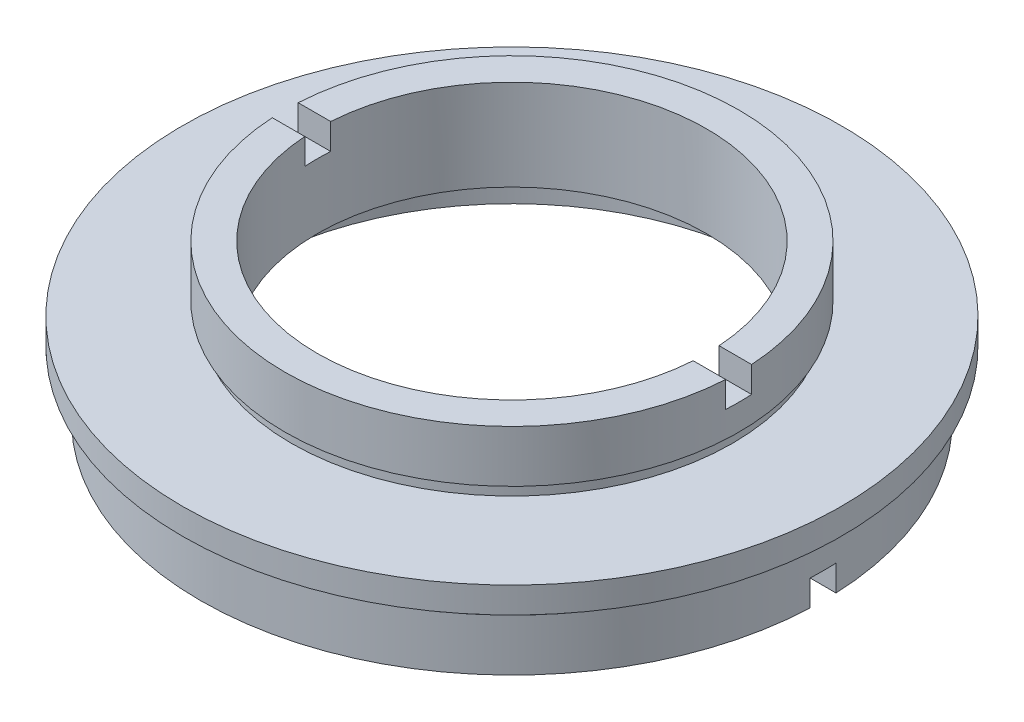
ISO-10303-21;
HEADER;
FILE_DESCRIPTION(('STEP AP214'),'2;1');
FILE_NAME('part.step','',(''),(''),'','','');
FILE_SCHEMA(('AUTOMOTIVE_DESIGN { 1 0 10303 214 1 1 1 1 }'));
ENDSEC;
DATA;
#1=APPLICATION_CONTEXT('core data for automotive mechanical design processes');
#2=APPLICATION_PROTOCOL_DEFINITION('international standard','automotive_design',2000,#1);
#3=PRODUCT_CONTEXT('',#1,'mechanical');
#4=PRODUCT('Part','Part','',(#3));
#5=PRODUCT_RELATED_PRODUCT_CATEGORY('part','',(#4));
#6=PRODUCT_DEFINITION_FORMATION('','',#4);
#7=PRODUCT_DEFINITION_CONTEXT('part definition',#1,'design');
#8=PRODUCT_DEFINITION('design','',#6,#7);
#9=PRODUCT_DEFINITION_SHAPE('','',#8);
#10=(LENGTH_UNIT() NAMED_UNIT(*) SI_UNIT(.MILLI.,.METRE.));
#11=(NAMED_UNIT(*) PLANE_ANGLE_UNIT() SI_UNIT($,.RADIAN.));
#12=(NAMED_UNIT(*) SI_UNIT($,.STERADIAN.) SOLID_ANGLE_UNIT());
#13=UNCERTAINTY_MEASURE_WITH_UNIT(LENGTH_MEASURE(1.E-05),#10,'distance_accuracy_value','');
#14=(GEOMETRIC_REPRESENTATION_CONTEXT(3) GLOBAL_UNCERTAINTY_ASSIGNED_CONTEXT((#13)) GLOBAL_UNIT_ASSIGNED_CONTEXT((#10,
#11,#12)) REPRESENTATION_CONTEXT('',''));
#15=CARTESIAN_POINT('',(0.,0.,0.));
#16=DIRECTION('',(0.,0.,1.));
#17=DIRECTION('',(1.,0.,0.));
#18=AXIS2_PLACEMENT_3D('',#15,#16,#17);
#19=CARTESIAN_POINT('',(-24.,0.,0.));
#20=DIRECTION('',(0.,-1.,0.));
#21=DIRECTION('',(0.,0.,-1.));
#22=AXIS2_PLACEMENT_3D('',#19,#20,#21);
#23=PLANE('',#22);
#24=DIRECTION('',(-1.,0.,0.));
#25=VECTOR('',#24,1.);
#26=CARTESIAN_POINT('',(-24.,0.,1.));
#27=LINE('',#26,#25);
#28=CARTESIAN_POINT('',(23.9791576165636,0.,1.));
#29=VERTEX_POINT('',#28);
#30=CARTESIAN_POINT('',(20.4755952294433,0.,1.));
#31=VERTEX_POINT('',#30);
#32=EDGE_CURVE('E183',#29,#31,#27,.T.);
#33=ORIENTED_EDGE('',*,*,#32,.F.);
#34=CARTESIAN_POINT('',(0.,0.,0.));
#35=DIRECTION('',(0.,1.,0.));
#36=DIRECTION('',(0.,0.,1.));
#37=AXIS2_PLACEMENT_3D('',#34,#35,#36);
#38=CIRCLE('',#37,24.);
#39=CARTESIAN_POINT('',(-23.9791576165636,0.,1.));
#40=VERTEX_POINT('',#39);
#41=EDGE_CURVE('E238',#40,#29,#38,.T.);
#42=ORIENTED_EDGE('',*,*,#41,.F.);
#43=CARTESIAN_POINT('',(-20.4755952294433,0.,1.));
#44=VERTEX_POINT('',#43);
#45=EDGE_CURVE('E161',#44,#40,#27,.T.);
#46=ORIENTED_EDGE('',*,*,#45,.F.);
#47=CARTESIAN_POINT('',(0.,0.,0.));
#48=DIRECTION('',(0.,1.,0.));
#49=DIRECTION('',(0.,0.,1.));
#50=AXIS2_PLACEMENT_3D('',#47,#48,#49);
#51=CIRCLE('',#50,20.5);
#52=EDGE_CURVE('E234',#44,#31,#51,.T.);
#53=ORIENTED_EDGE('',*,*,#52,.T.);
#54=EDGE_LOOP('',(#33,#42,#46,#53));
#55=FACE_BOUND('',#54,.T.);
#56=ADVANCED_FACE('F38',(#55),#23,.T.);
#57=CARTESIAN_POINT('',(-15.,12.,0.));
#58=DIRECTION('',(0.,1.,0.));
#59=DIRECTION('',(0.,0.,1.));
#60=AXIS2_PLACEMENT_3D('',#57,#58,#59);
#61=PLANE('',#60);
#62=DIRECTION('',(1.,0.,0.));
#63=VECTOR('',#62,1.);
#64=CARTESIAN_POINT('',(-15.,12.,1.));
#65=LINE('',#64,#63);
#66=CARTESIAN_POINT('',(-17.4714052096561,12.,1.));
#67=VERTEX_POINT('',#66);
#68=CARTESIAN_POINT('',(-14.9666295470958,12.,1.));
#69=VERTEX_POINT('',#68);
#70=EDGE_CURVE('E270',#67,#69,#65,.T.);
#71=ORIENTED_EDGE('',*,*,#70,.F.);
#72=CARTESIAN_POINT('',(0.,12.,0.));
#73=DIRECTION('',(0.,1.,0.));
#74=DIRECTION('',(0.,0.,1.));
#75=AXIS2_PLACEMENT_3D('',#72,#73,#74);
#76=CIRCLE('',#75,17.5);
#77=CARTESIAN_POINT('',(17.4714052096561,12.,1.));
#78=VERTEX_POINT('',#77);
#79=EDGE_CURVE('E214',#67,#78,#76,.T.);
#80=ORIENTED_EDGE('',*,*,#79,.T.);
#81=CARTESIAN_POINT('',(14.9666295470958,12.,1.));
#82=VERTEX_POINT('',#81);
#83=EDGE_CURVE('E268',#82,#78,#65,.T.);
#84=ORIENTED_EDGE('',*,*,#83,.F.);
#85=CARTESIAN_POINT('',(0.,12.,0.));
#86=DIRECTION('',(0.,1.,0.));
#87=DIRECTION('',(0.,0.,1.));
#88=AXIS2_PLACEMENT_3D('',#85,#86,#87);
#89=CIRCLE('',#88,15.);
#90=EDGE_CURVE('E218',#69,#82,#89,.T.);
#91=ORIENTED_EDGE('',*,*,#90,.F.);
#92=EDGE_LOOP('',(#71,#80,#84,#91));
#93=FACE_BOUND('',#92,.T.);
#94=ADVANCED_FACE('F319',(#93),#61,.T.);
#95=CARTESIAN_POINT('',(0.,22.6774994510759,0.));
#96=DIRECTION('',(0.,1.,0.));
#97=DIRECTION('',(0.,0.,1.));
#98=AXIS2_PLACEMENT_3D('',#95,#96,#97);
#99=CYLINDRICAL_SURFACE('',#98,17.5);
#100=DIRECTION('',(0.,1.,0.));
#101=VECTOR('',#100,1.);
#102=CARTESIAN_POINT('',(-17.4714052096561,22.6774994510759,1.));
#103=LINE('',#102,#101);
#104=CARTESIAN_POINT('',(-17.4714052096561,10.,1.));
#105=VERTEX_POINT('',#104);
#106=EDGE_CURVE('E209',#105,#67,#103,.T.);
#107=ORIENTED_EDGE('',*,*,#106,.F.);
#108=CARTESIAN_POINT('',(0.,10.,0.));
#109=DIRECTION('',(0.,-1.,0.));
#110=DIRECTION('',(0.,0.,-1.));
#111=AXIS2_PLACEMENT_3D('',#108,#109,#110);
#112=CIRCLE('',#111,17.5);
#113=CARTESIAN_POINT('',(-17.4714052096561,10.,-0.999999999999997));
#114=VERTEX_POINT('',#113);
#115=EDGE_CURVE('E213',#114,#105,#112,.F.);
#116=ORIENTED_EDGE('',*,*,#115,.F.);
#117=DIRECTION('',(0.,1.,0.));
#118=VECTOR('',#117,1.);
#119=CARTESIAN_POINT('',(-17.4714052096561,22.6774994510759,-1.));
#120=LINE('',#119,#118);
#121=CARTESIAN_POINT('',(-17.4714052096561,12.,-0.999999999999998));
#122=VERTEX_POINT('',#121);
#123=EDGE_CURVE('E197',#122,#114,#120,.F.);
#124=ORIENTED_EDGE('',*,*,#123,.F.);
#125=CARTESIAN_POINT('',(17.4714052096561,12.,-0.999999999999998));
#126=VERTEX_POINT('',#125);
#127=EDGE_CURVE('E217',#126,#122,#76,.T.);
#128=ORIENTED_EDGE('',*,*,#127,.F.);
#129=DIRECTION('',(0.,1.,0.));
#130=VECTOR('',#129,1.);
#131=CARTESIAN_POINT('',(17.4714052096561,22.6774994510759,-1.));
#132=LINE('',#131,#130);
#133=CARTESIAN_POINT('',(17.4714052096561,10.,-0.999999999999997));
#134=VERTEX_POINT('',#133);
#135=EDGE_CURVE('E201',#134,#126,#132,.T.);
#136=ORIENTED_EDGE('',*,*,#135,.F.);
#137=CARTESIAN_POINT('',(17.4714052096561,10.,1.));
#138=VERTEX_POINT('',#137);
#139=EDGE_CURVE('E211',#138,#134,#112,.F.);
#140=ORIENTED_EDGE('',*,*,#139,.F.);
#141=DIRECTION('',(0.,1.,0.));
#142=VECTOR('',#141,1.);
#143=CARTESIAN_POINT('',(17.4714052096561,22.6774994510759,1.));
#144=LINE('',#143,#142);
#145=EDGE_CURVE('E205',#78,#138,#144,.F.);
#146=ORIENTED_EDGE('',*,*,#145,.F.);
#147=ORIENTED_EDGE('',*,*,#79,.F.);
#148=EDGE_LOOP('',(#107,#116,#124,#128,#136,#140,#146,#147));
#149=FACE_BOUND('',#148,.T.);
#150=CARTESIAN_POINT('',(0.,8.,0.));
#151=DIRECTION('',(0.,1.,0.));
#152=DIRECTION('',(0.,0.,1.));
#153=AXIS2_PLACEMENT_3D('',#150,#151,#152);
#154=CIRCLE('',#153,17.5);
#155=CARTESIAN_POINT('',(0.,8.,17.5));
#156=VERTEX_POINT('',#155);
#157=EDGE_CURVE('E262',#156,#156,#154,.T.);
#158=ORIENTED_EDGE('',*,*,#157,.T.);
#159=EDGE_LOOP('',(#158));
#160=FACE_BOUND('',#159,.T.);
#161=ADVANCED_FACE('F40',(#149,#160),#99,.T.);
#162=CARTESIAN_POINT('',(-17.5,8.,0.));
#163=DIRECTION('',(0.,-1.,0.));
#164=DIRECTION('',(0.,0.,-1.));
#165=AXIS2_PLACEMENT_3D('',#162,#163,#164);
#166=PLANE('',#165);
#167=CARTESIAN_POINT('',(0.,8.,0.));
#168=DIRECTION('',(0.,1.,0.));
#169=DIRECTION('',(0.,0.,1.));
#170=AXIS2_PLACEMENT_3D('',#167,#168,#169);
#171=CIRCLE('',#170,17.);
#172=CARTESIAN_POINT('',(0.,8.,17.));
#173=VERTEX_POINT('',#172);
#174=EDGE_CURVE('E259',#173,#173,#171,.T.);
#175=ORIENTED_EDGE('',*,*,#174,.T.);
#176=EDGE_LOOP('',(#175));
#177=FACE_BOUND('',#176,.T.);
#178=ORIENTED_EDGE('',*,*,#157,.F.);
#179=EDGE_LOOP('',(#178));
#180=FACE_BOUND('',#179,.T.);
#181=ADVANCED_FACE('F329',(#177,#180),#166,.T.);
#182=CARTESIAN_POINT('',(0.,22.6774994510759,0.));
#183=DIRECTION('',(0.,1.,0.));
#184=DIRECTION('',(0.,0.,1.));
#185=AXIS2_PLACEMENT_3D('',#182,#183,#184);
#186=CYLINDRICAL_SURFACE('',#185,17.);
#187=CARTESIAN_POINT('',(0.,7.,0.));
#188=DIRECTION('',(0.,1.,0.));
#189=DIRECTION('',(0.,0.,1.));
#190=AXIS2_PLACEMENT_3D('',#187,#188,#189);
#191=CIRCLE('',#190,17.);
#192=CARTESIAN_POINT('',(0.,7.,17.));
#193=VERTEX_POINT('',#192);
#194=EDGE_CURVE('E256',#193,#193,#191,.T.);
#195=ORIENTED_EDGE('',*,*,#194,.T.);
#196=EDGE_LOOP('',(#195));
#197=FACE_BOUND('',#196,.T.);
#198=ORIENTED_EDGE('',*,*,#174,.F.);
#199=EDGE_LOOP('',(#198));
#200=FACE_BOUND('',#199,.T.);
#201=ADVANCED_FACE('F569',(#197,#200),#186,.T.);
#202=CARTESIAN_POINT('',(-17.,7.,0.));
#203=DIRECTION('',(0.,1.,0.));
#204=DIRECTION('',(0.,0.,1.));
#205=AXIS2_PLACEMENT_3D('',#202,#203,#204);
#206=PLANE('',#205);
#207=CARTESIAN_POINT('',(0.,7.,0.));
#208=DIRECTION('',(0.,1.,0.));
#209=DIRECTION('',(0.,0.,1.));
#210=AXIS2_PLACEMENT_3D('',#207,#208,#209);
#211=CIRCLE('',#210,25.4);
#212=CARTESIAN_POINT('',(0.,7.,25.4));
#213=VERTEX_POINT('',#212);
#214=EDGE_CURVE('E253',#213,#213,#211,.T.);
#215=ORIENTED_EDGE('',*,*,#214,.T.);
#216=EDGE_LOOP('',(#215));
#217=FACE_BOUND('',#216,.T.);
#218=ORIENTED_EDGE('',*,*,#194,.F.);
#219=EDGE_LOOP('',(#218));
#220=FACE_BOUND('',#219,.T.);
#221=ADVANCED_FACE('F560',(#217,#220),#206,.T.);
#222=CARTESIAN_POINT('',(0.,22.6774994510759,0.));
#223=DIRECTION('',(0.,1.,0.));
#224=DIRECTION('',(0.,0.,1.));
#225=AXIS2_PLACEMENT_3D('',#222,#223,#224);
#226=CYLINDRICAL_SURFACE('',#225,25.4);
#227=CARTESIAN_POINT('',(0.,5.,0.));
#228=DIRECTION('',(0.,1.,0.));
#229=DIRECTION('',(0.,0.,1.));
#230=AXIS2_PLACEMENT_3D('',#227,#228,#229);
#231=CIRCLE('',#230,25.4);
#232=CARTESIAN_POINT('',(0.,5.,25.4));
#233=VERTEX_POINT('',#232);
#234=EDGE_CURVE('E250',#233,#233,#231,.T.);
#235=ORIENTED_EDGE('',*,*,#234,.T.);
#236=EDGE_LOOP('',(#235));
#237=FACE_BOUND('',#236,.T.);
#238=ORIENTED_EDGE('',*,*,#214,.F.);
#239=EDGE_LOOP('',(#238));
#240=FACE_BOUND('',#239,.T.);
#241=ADVANCED_FACE('F551',(#237,#240),#226,.T.);
#242=CARTESIAN_POINT('',(-25.4,5.,0.));
#243=DIRECTION('',(0.,-1.,0.));
#244=DIRECTION('',(0.,0.,-1.));
#245=AXIS2_PLACEMENT_3D('',#242,#243,#244);
#246=PLANE('',#245);
#247=CARTESIAN_POINT('',(0.,5.,0.));
#248=DIRECTION('',(0.,1.,0.));
#249=DIRECTION('',(0.,0.,1.));
#250=AXIS2_PLACEMENT_3D('',#247,#248,#249);
#251=CIRCLE('',#250,23.5);
#252=CARTESIAN_POINT('',(0.,5.,23.5));
#253=VERTEX_POINT('',#252);
#254=EDGE_CURVE('E247',#253,#253,#251,.T.);
#255=ORIENTED_EDGE('',*,*,#254,.T.);
#256=EDGE_LOOP('',(#255));
#257=FACE_BOUND('',#256,.T.);
#258=ORIENTED_EDGE('',*,*,#234,.F.);
#259=EDGE_LOOP('',(#258));
#260=FACE_BOUND('',#259,.T.);
#261=ADVANCED_FACE('F542',(#257,#260),#246,.T.);
#262=CARTESIAN_POINT('',(0.,22.6774994510759,0.));
#263=DIRECTION('',(0.,1.,0.));
#264=DIRECTION('',(0.,0.,1.));
#265=AXIS2_PLACEMENT_3D('',#262,#263,#264);
#266=CYLINDRICAL_SURFACE('',#265,23.5);
#267=CARTESIAN_POINT('',(0.,4.,0.));
#268=DIRECTION('',(0.,1.,0.));
#269=DIRECTION('',(0.,0.,1.));
#270=AXIS2_PLACEMENT_3D('',#267,#268,#269);
#271=CIRCLE('',#270,23.5);
#272=CARTESIAN_POINT('',(0.,4.,23.5));
#273=VERTEX_POINT('',#272);
#274=EDGE_CURVE('E244',#273,#273,#271,.T.);
#275=ORIENTED_EDGE('',*,*,#274,.T.);
#276=EDGE_LOOP('',(#275));
#277=FACE_BOUND('',#276,.T.);
#278=ORIENTED_EDGE('',*,*,#254,.F.);
#279=EDGE_LOOP('',(#278));
#280=FACE_BOUND('',#279,.T.);
#281=ADVANCED_FACE('F533',(#277,#280),#266,.T.);
#282=CARTESIAN_POINT('',(-23.5,4.,0.));
#283=DIRECTION('',(0.,1.,0.));
#284=DIRECTION('',(0.,0.,1.));
#285=AXIS2_PLACEMENT_3D('',#282,#283,#284);
#286=PLANE('',#285);
#287=CARTESIAN_POINT('',(0.,4.,0.));
#288=DIRECTION('',(0.,1.,0.));
#289=DIRECTION('',(0.,0.,1.));
#290=AXIS2_PLACEMENT_3D('',#287,#288,#289);
#291=CIRCLE('',#290,24.);
#292=CARTESIAN_POINT('',(0.,4.,24.));
#293=VERTEX_POINT('',#292);
#294=EDGE_CURVE('E241',#293,#293,#291,.T.);
#295=ORIENTED_EDGE('',*,*,#294,.T.);
#296=EDGE_LOOP('',(#295));
#297=FACE_BOUND('',#296,.T.);
#298=ORIENTED_EDGE('',*,*,#274,.F.);
#299=EDGE_LOOP('',(#298));
#300=FACE_BOUND('',#299,.T.);
#301=ADVANCED_FACE('F316',(#297,#300),#286,.T.);
#302=CARTESIAN_POINT('',(0.,22.6774994510759,0.));
#303=DIRECTION('',(0.,1.,0.));
#304=DIRECTION('',(0.,0.,1.));
#305=AXIS2_PLACEMENT_3D('',#302,#303,#304);
#306=CYLINDRICAL_SURFACE('',#305,24.);
#307=DIRECTION('',(0.,1.,0.));
#308=VECTOR('',#307,1.);
#309=CARTESIAN_POINT('',(-23.9791576165636,22.6774994510759,1.));
#310=LINE('',#309,#308);
#311=CARTESIAN_POINT('',(-23.9791576165636,2.,1.));
#312=VERTEX_POINT('',#311);
#313=EDGE_CURVE('E182',#40,#312,#310,.T.);
#314=ORIENTED_EDGE('',*,*,#313,.F.);
#315=ORIENTED_EDGE('',*,*,#41,.T.);
#316=DIRECTION('',(0.,1.,0.));
#317=VECTOR('',#316,1.);
#318=CARTESIAN_POINT('',(23.9791576165636,22.6774994510759,1.));
#319=LINE('',#318,#317);
#320=CARTESIAN_POINT('',(23.9791576165636,2.,1.));
#321=VERTEX_POINT('',#320);
#322=EDGE_CURVE('E185',#321,#29,#319,.F.);
#323=ORIENTED_EDGE('',*,*,#322,.F.);
#324=CARTESIAN_POINT('',(0.,2.,0.));
#325=DIRECTION('',(0.,1.,0.));
#326=DIRECTION('',(0.,0.,1.));
#327=AXIS2_PLACEMENT_3D('',#324,#325,#326);
#328=CIRCLE('',#327,24.);
#329=CARTESIAN_POINT('',(23.9791576165636,2.,-1.));
#330=VERTEX_POINT('',#329);
#331=EDGE_CURVE('E162',#330,#321,#328,.F.);
#332=ORIENTED_EDGE('',*,*,#331,.F.);
#333=DIRECTION('',(0.,1.,0.));
#334=VECTOR('',#333,1.);
#335=CARTESIAN_POINT('',(23.9791576165636,22.6774994510759,-0.999999999999994));
#336=LINE('',#335,#334);
#337=CARTESIAN_POINT('',(23.9791576165636,0.,-1.));
#338=VERTEX_POINT('',#337);
#339=EDGE_CURVE('E176',#338,#330,#336,.T.);
#340=ORIENTED_EDGE('',*,*,#339,.F.);
#341=CARTESIAN_POINT('',(-23.9791576165636,0.,-1.));
#342=VERTEX_POINT('',#341);
#343=EDGE_CURVE('E174',#338,#342,#38,.T.);
#344=ORIENTED_EDGE('',*,*,#343,.T.);
#345=DIRECTION('',(0.,1.,0.));
#346=VECTOR('',#345,1.);
#347=CARTESIAN_POINT('',(-23.9791576165636,22.6774994510759,-0.999999999999994));
#348=LINE('',#347,#346);
#349=CARTESIAN_POINT('',(-23.9791576165636,2.,-1.));
#350=VERTEX_POINT('',#349);
#351=EDGE_CURVE('E165',#350,#342,#348,.F.);
#352=ORIENTED_EDGE('',*,*,#351,.F.);
#353=EDGE_CURVE('E151',#312,#350,#328,.F.);
#354=ORIENTED_EDGE('',*,*,#353,.F.);
#355=EDGE_LOOP('',(#314,#315,#323,#332,#340,#344,#352,#354));
#356=FACE_BOUND('',#355,.T.);
#357=ORIENTED_EDGE('',*,*,#294,.F.);
#358=EDGE_LOOP('',(#357));
#359=FACE_BOUND('',#358,.T.);
#360=ADVANCED_FACE('F170',(#356,#359),#306,.T.);
#361=DIRECTION('',(1.,0.,0.));
#362=VECTOR('',#361,1.);
#363=CARTESIAN_POINT('',(-24.,0.,-1.));
#364=LINE('',#363,#362);
#365=CARTESIAN_POINT('',(-20.4755952294433,0.,-0.999999999999995));
#366=VERTEX_POINT('',#365);
#367=EDGE_CURVE('E61',#342,#366,#364,.T.);
#368=ORIENTED_EDGE('',*,*,#367,.F.);
#369=ORIENTED_EDGE('',*,*,#343,.F.);
#370=CARTESIAN_POINT('',(20.4755952294433,0.,-0.999999999999994));
#371=VERTEX_POINT('',#370);
#372=EDGE_CURVE('E178',#371,#338,#364,.T.);
#373=ORIENTED_EDGE('',*,*,#372,.F.);
#374=EDGE_CURVE('E237',#371,#366,#51,.T.);
#375=ORIENTED_EDGE('',*,*,#374,.T.);
#376=EDGE_LOOP('',(#368,#369,#373,#375));
#377=FACE_BOUND('',#376,.T.);
#378=ADVANCED_FACE('F307',(#377),#23,.T.);
#379=CARTESIAN_POINT('',(0.,22.6774994510759,0.));
#380=DIRECTION('',(0.,1.,0.));
#381=DIRECTION('',(0.,0.,1.));
#382=AXIS2_PLACEMENT_3D('',#379,#380,#381);
#383=CYLINDRICAL_SURFACE('',#382,20.5);
#384=DIRECTION('',(0.,1.,0.));
#385=VECTOR('',#384,1.);
#386=CARTESIAN_POINT('',(-20.4755952294433,22.6774994510759,1.));
#387=LINE('',#386,#385);
#388=CARTESIAN_POINT('',(-20.4755952294433,2.,1.));
#389=VERTEX_POINT('',#388);
#390=EDGE_CURVE('E12',#389,#44,#387,.F.);
#391=ORIENTED_EDGE('',*,*,#390,.F.);
#392=CARTESIAN_POINT('',(0.,2.,0.));
#393=DIRECTION('',(0.,1.,0.));
#394=DIRECTION('',(0.,0.,1.));
#395=AXIS2_PLACEMENT_3D('',#392,#393,#394);
#396=CIRCLE('',#395,20.5);
#397=CARTESIAN_POINT('',(-20.4755952294433,2.,-1.));
#398=VERTEX_POINT('',#397);
#399=EDGE_CURVE('E46',#398,#389,#396,.T.);
#400=ORIENTED_EDGE('',*,*,#399,.F.);
#401=DIRECTION('',(0.,1.,0.));
#402=VECTOR('',#401,1.);
#403=CARTESIAN_POINT('',(-20.4755952294433,22.6774994510759,-0.999999999999994));
#404=LINE('',#403,#402);
#405=EDGE_CURVE('E166',#366,#398,#404,.T.);
#406=ORIENTED_EDGE('',*,*,#405,.F.);
#407=ORIENTED_EDGE('',*,*,#374,.F.);
#408=DIRECTION('',(0.,1.,0.));
#409=VECTOR('',#408,1.);
#410=CARTESIAN_POINT('',(20.4755952294433,22.6774994510759,-0.999999999999994));
#411=LINE('',#410,#409);
#412=CARTESIAN_POINT('',(20.4755952294433,2.,-0.999999999999994));
#413=VERTEX_POINT('',#412);
#414=EDGE_CURVE('E274',#413,#371,#411,.F.);
#415=ORIENTED_EDGE('',*,*,#414,.F.);
#416=CARTESIAN_POINT('',(20.4755952294433,2.,1.));
#417=VERTEX_POINT('',#416);
#418=EDGE_CURVE('E276',#417,#413,#396,.T.);
#419=ORIENTED_EDGE('',*,*,#418,.F.);
#420=DIRECTION('',(0.,1.,0.));
#421=VECTOR('',#420,1.);
#422=CARTESIAN_POINT('',(20.4755952294433,22.6774994510759,1.));
#423=LINE('',#422,#421);
#424=EDGE_CURVE('E278',#31,#417,#423,.T.);
#425=ORIENTED_EDGE('',*,*,#424,.F.);
#426=ORIENTED_EDGE('',*,*,#52,.F.);
#427=EDGE_LOOP('',(#391,#400,#406,#407,#415,#419,#425,#426));
#428=FACE_BOUND('',#427,.T.);
#429=CARTESIAN_POINT('',(0.,4.,0.));
#430=DIRECTION('',(0.,1.,0.));
#431=DIRECTION('',(0.,0.,1.));
#432=AXIS2_PLACEMENT_3D('',#429,#430,#431);
#433=CIRCLE('',#432,20.5);
#434=CARTESIAN_POINT('',(0.,4.,20.5));
#435=VERTEX_POINT('',#434);
#436=EDGE_CURVE('E231',#435,#435,#433,.T.);
#437=ORIENTED_EDGE('',*,*,#436,.T.);
#438=EDGE_LOOP('',(#437));
#439=FACE_BOUND('',#438,.T.);
#440=ADVANCED_FACE('F286',(#428,#439),#383,.F.);
#441=CARTESIAN_POINT('',(-21.1,4.,0.));
#442=DIRECTION('',(0.,1.,0.));
#443=DIRECTION('',(0.,0.,1.));
#444=AXIS2_PLACEMENT_3D('',#441,#442,#443);
#445=PLANE('',#444);
#446=CARTESIAN_POINT('',(0.,4.,0.));
#447=DIRECTION('',(0.,1.,0.));
#448=DIRECTION('',(0.,0.,1.));
#449=AXIS2_PLACEMENT_3D('',#446,#447,#448);
#450=CIRCLE('',#449,21.1);
#451=CARTESIAN_POINT('',(0.,4.,21.1));
#452=VERTEX_POINT('',#451);
#453=EDGE_CURVE('E228',#452,#452,#450,.T.);
#454=ORIENTED_EDGE('',*,*,#453,.T.);
#455=EDGE_LOOP('',(#454));
#456=FACE_BOUND('',#455,.T.);
#457=ORIENTED_EDGE('',*,*,#436,.F.);
#458=EDGE_LOOP('',(#457));
#459=FACE_BOUND('',#458,.T.);
#460=ADVANCED_FACE('F314',(#456,#459),#445,.T.);
#461=CARTESIAN_POINT('',(0.,22.6774994510759,0.));
#462=DIRECTION('',(0.,1.,0.));
#463=DIRECTION('',(0.,0.,1.));
#464=AXIS2_PLACEMENT_3D('',#461,#462,#463);
#465=CYLINDRICAL_SURFACE('',#464,21.1);
#466=CARTESIAN_POINT('',(0.,5.,0.));
#467=DIRECTION('',(0.,1.,0.));
#468=DIRECTION('',(0.,0.,1.));
#469=AXIS2_PLACEMENT_3D('',#466,#467,#468);
#470=CIRCLE('',#469,21.1);
#471=CARTESIAN_POINT('',(0.,5.,21.1));
#472=VERTEX_POINT('',#471);
#473=EDGE_CURVE('E225',#472,#472,#470,.T.);
#474=ORIENTED_EDGE('',*,*,#473,.T.);
#475=EDGE_LOOP('',(#474));
#476=FACE_BOUND('',#475,.T.);
#477=ORIENTED_EDGE('',*,*,#453,.F.);
#478=EDGE_LOOP('',(#477));
#479=FACE_BOUND('',#478,.T.);
#480=ADVANCED_FACE('F492',(#476,#479),#465,.F.);
#481=CARTESIAN_POINT('',(-15.,5.,0.));
#482=DIRECTION('',(0.,-1.,0.));
#483=DIRECTION('',(0.,0.,-1.));
#484=AXIS2_PLACEMENT_3D('',#481,#482,#483);
#485=PLANE('',#484);
#486=CARTESIAN_POINT('',(0.,5.,0.));
#487=DIRECTION('',(0.,1.,0.));
#488=DIRECTION('',(0.,0.,1.));
#489=AXIS2_PLACEMENT_3D('',#486,#487,#488);
#490=CIRCLE('',#489,15.);
#491=CARTESIAN_POINT('',(0.,5.,15.));
#492=VERTEX_POINT('',#491);
#493=EDGE_CURVE('E222',#492,#492,#490,.T.);
#494=ORIENTED_EDGE('',*,*,#493,.T.);
#495=EDGE_LOOP('',(#494));
#496=FACE_BOUND('',#495,.T.);
#497=ORIENTED_EDGE('',*,*,#473,.F.);
#498=EDGE_LOOP('',(#497));
#499=FACE_BOUND('',#498,.T.);
#500=ADVANCED_FACE('F345',(#496,#499),#485,.T.);
#501=CARTESIAN_POINT('',(0.,22.6774994510759,0.));
#502=DIRECTION('',(0.,1.,0.));
#503=DIRECTION('',(0.,0.,1.));
#504=AXIS2_PLACEMENT_3D('',#501,#502,#503);
#505=CYLINDRICAL_SURFACE('',#504,15.);
#506=DIRECTION('',(0.,1.,0.));
#507=VECTOR('',#506,1.);
#508=CARTESIAN_POINT('',(14.9666295470958,22.6774994510759,1.));
#509=LINE('',#508,#507);
#510=CARTESIAN_POINT('',(14.9666295470958,10.,1.));
#511=VERTEX_POINT('',#510);
#512=EDGE_CURVE('E203',#511,#82,#509,.T.);
#513=ORIENTED_EDGE('',*,*,#512,.F.);
#514=CARTESIAN_POINT('',(0.,10.,0.));
#515=DIRECTION('',(0.,-1.,0.));
#516=DIRECTION('',(0.,0.,-1.));
#517=AXIS2_PLACEMENT_3D('',#514,#515,#516);
#518=CIRCLE('',#517,15.);
#519=CARTESIAN_POINT('',(14.9666295470958,10.,-0.999999999999997));
#520=VERTEX_POINT('',#519);
#521=EDGE_CURVE('E273',#520,#511,#518,.T.);
#522=ORIENTED_EDGE('',*,*,#521,.F.);
#523=DIRECTION('',(0.,1.,0.));
#524=VECTOR('',#523,1.);
#525=CARTESIAN_POINT('',(14.9666295470958,22.6774994510759,-1.));
#526=LINE('',#525,#524);
#527=CARTESIAN_POINT('',(14.9666295470958,12.,-0.999999999999998));
#528=VERTEX_POINT('',#527);
#529=EDGE_CURVE('E199',#528,#520,#526,.F.);
#530=ORIENTED_EDGE('',*,*,#529,.F.);
#531=CARTESIAN_POINT('',(-14.9666295470958,12.,-0.999999999999998));
#532=VERTEX_POINT('',#531);
#533=EDGE_CURVE('E221',#528,#532,#89,.T.);
#534=ORIENTED_EDGE('',*,*,#533,.T.);
#535=DIRECTION('',(0.,1.,0.));
#536=VECTOR('',#535,1.);
#537=CARTESIAN_POINT('',(-14.9666295470958,22.6774994510759,-1.));
#538=LINE('',#537,#536);
#539=CARTESIAN_POINT('',(-14.9666295470958,10.,-0.999999999999997));
#540=VERTEX_POINT('',#539);
#541=EDGE_CURVE('E195',#540,#532,#538,.T.);
#542=ORIENTED_EDGE('',*,*,#541,.F.);
#543=CARTESIAN_POINT('',(-14.9666295470958,10.,1.));
#544=VERTEX_POINT('',#543);
#545=EDGE_CURVE('E271',#544,#540,#518,.T.);
#546=ORIENTED_EDGE('',*,*,#545,.F.);
#547=DIRECTION('',(0.,1.,0.));
#548=VECTOR('',#547,1.);
#549=CARTESIAN_POINT('',(-14.9666295470958,22.6774994510759,1.));
#550=LINE('',#549,#548);
#551=EDGE_CURVE('E207',#69,#544,#550,.F.);
#552=ORIENTED_EDGE('',*,*,#551,.F.);
#553=ORIENTED_EDGE('',*,*,#90,.T.);
#554=EDGE_LOOP('',(#513,#522,#530,#534,#542,#546,#552,#553));
#555=FACE_BOUND('',#554,.T.);
#556=ORIENTED_EDGE('',*,*,#493,.F.);
#557=EDGE_LOOP('',(#556));
#558=FACE_BOUND('',#557,.T.);
#559=ADVANCED_FACE('F336',(#555,#558),#505,.F.);
#560=DIRECTION('',(-1.,0.,0.));
#561=VECTOR('',#560,1.);
#562=CARTESIAN_POINT('',(-15.,12.,-0.999999999999998));
#563=LINE('',#562,#561);
#564=EDGE_CURVE('E267',#126,#528,#563,.T.);
#565=ORIENTED_EDGE('',*,*,#564,.F.);
#566=ORIENTED_EDGE('',*,*,#127,.T.);
#567=EDGE_CURVE('E265',#532,#122,#563,.T.);
#568=ORIENTED_EDGE('',*,*,#567,.F.);
#569=ORIENTED_EDGE('',*,*,#533,.F.);
#570=EDGE_LOOP('',(#565,#566,#568,#569));
#571=FACE_BOUND('',#570,.T.);
#572=ADVANCED_FACE('F325',(#571),#61,.T.);
#573=CARTESIAN_POINT('',(-39.5,13.5939878717808,1.));
#574=DIRECTION('',(0.,0.,1.));
#575=DIRECTION('',(0.,-1.,0.));
#576=AXIS2_PLACEMENT_3D('',#573,#574,#575);
#577=PLANE('',#576);
#578=ORIENTED_EDGE('',*,*,#106,.T.);
#579=ORIENTED_EDGE('',*,*,#70,.T.);
#580=ORIENTED_EDGE('',*,*,#551,.T.);
#581=DIRECTION('',(1.,0.,0.));
#582=VECTOR('',#581,1.);
#583=CARTESIAN_POINT('',(-39.5,10.,1.));
#584=LINE('',#583,#582);
#585=EDGE_CURVE('E192',#105,#544,#584,.T.);
#586=ORIENTED_EDGE('',*,*,#585,.F.);
#587=EDGE_LOOP('',(#578,#579,#580,#586));
#588=FACE_BOUND('',#587,.T.);
#589=ADVANCED_FACE('F335',(#588),#577,.F.);
#590=CARTESIAN_POINT('',(-39.5,13.5939878717808,-0.999999999999998));
#591=DIRECTION('',(0.,0.,-1.));
#592=DIRECTION('',(0.,1.,0.));
#593=AXIS2_PLACEMENT_3D('',#590,#591,#592);
#594=PLANE('',#593);
#595=ORIENTED_EDGE('',*,*,#123,.T.);
#596=DIRECTION('',(1.,0.,0.));
#597=VECTOR('',#596,1.);
#598=CARTESIAN_POINT('',(-39.5,10.,-0.999999999999997));
#599=LINE('',#598,#597);
#600=EDGE_CURVE('E191',#114,#540,#599,.T.);
#601=ORIENTED_EDGE('',*,*,#600,.T.);
#602=ORIENTED_EDGE('',*,*,#541,.T.);
#603=ORIENTED_EDGE('',*,*,#567,.T.);
#604=EDGE_LOOP('',(#595,#601,#602,#603));
#605=FACE_BOUND('',#604,.T.);
#606=ADVANCED_FACE('F342',(#605),#594,.F.);
#607=CARTESIAN_POINT('',(-39.5,10.,1.));
#608=DIRECTION('',(0.,-1.,0.));
#609=DIRECTION('',(0.,0.,-1.));
#610=AXIS2_PLACEMENT_3D('',#607,#608,#609);
#611=PLANE('',#610);
#612=ORIENTED_EDGE('',*,*,#115,.T.);
#613=ORIENTED_EDGE('',*,*,#585,.T.);
#614=ORIENTED_EDGE('',*,*,#545,.T.);
#615=ORIENTED_EDGE('',*,*,#600,.F.);
#616=EDGE_LOOP('',(#612,#613,#614,#615));
#617=FACE_BOUND('',#616,.T.);
#618=ADVANCED_FACE('F366',(#617),#611,.F.);
#619=ORIENTED_EDGE('',*,*,#139,.T.);
#620=EDGE_CURVE('E188',#520,#134,#599,.T.);
#621=ORIENTED_EDGE('',*,*,#620,.F.);
#622=ORIENTED_EDGE('',*,*,#521,.T.);
#623=EDGE_CURVE('E187',#511,#138,#584,.T.);
#624=ORIENTED_EDGE('',*,*,#623,.T.);
#625=EDGE_LOOP('',(#619,#621,#622,#624));
#626=FACE_BOUND('',#625,.T.);
#627=ADVANCED_FACE('F378',(#626),#611,.F.);
#628=ORIENTED_EDGE('',*,*,#135,.T.);
#629=ORIENTED_EDGE('',*,*,#564,.T.);
#630=ORIENTED_EDGE('',*,*,#529,.T.);
#631=ORIENTED_EDGE('',*,*,#620,.T.);
#632=EDGE_LOOP('',(#628,#629,#630,#631));
#633=FACE_BOUND('',#632,.T.);
#634=ADVANCED_FACE('F376',(#633),#594,.F.);
#635=ORIENTED_EDGE('',*,*,#145,.T.);
#636=ORIENTED_EDGE('',*,*,#623,.F.);
#637=ORIENTED_EDGE('',*,*,#512,.T.);
#638=ORIENTED_EDGE('',*,*,#83,.T.);
#639=EDGE_LOOP('',(#635,#636,#637,#638));
#640=FACE_BOUND('',#639,.T.);
#641=ADVANCED_FACE('F344',(#640),#577,.F.);
#642=CARTESIAN_POINT('',(-39.5,2.,-1.));
#643=DIRECTION('',(0.,0.,-1.));
#644=DIRECTION('',(0.,1.,0.));
#645=AXIS2_PLACEMENT_3D('',#642,#643,#644);
#646=PLANE('',#645);
#647=ORIENTED_EDGE('',*,*,#339,.T.);
#648=DIRECTION('',(1.,0.,0.));
#649=VECTOR('',#648,1.);
#650=CARTESIAN_POINT('',(-39.5,2.,-1.));
#651=LINE('',#650,#649);
#652=EDGE_CURVE('E53',#413,#330,#651,.T.);
#653=ORIENTED_EDGE('',*,*,#652,.F.);
#654=ORIENTED_EDGE('',*,*,#414,.T.);
#655=ORIENTED_EDGE('',*,*,#372,.T.);
#656=EDGE_LOOP('',(#647,#653,#654,#655));
#657=FACE_BOUND('',#656,.T.);
#658=ADVANCED_FACE('F301',(#657),#646,.F.);
#659=CARTESIAN_POINT('',(-39.5,2.,1.));
#660=DIRECTION('',(0.,1.,0.));
#661=DIRECTION('',(0.,0.,1.));
#662=AXIS2_PLACEMENT_3D('',#659,#660,#661);
#663=PLANE('',#662);
#664=ORIENTED_EDGE('',*,*,#331,.T.);
#665=DIRECTION('',(1.,0.,0.));
#666=VECTOR('',#665,1.);
#667=CARTESIAN_POINT('',(-39.5,2.,1.));
#668=LINE('',#667,#666);
#669=EDGE_CURVE('E167',#417,#321,#668,.T.);
#670=ORIENTED_EDGE('',*,*,#669,.F.);
#671=ORIENTED_EDGE('',*,*,#418,.T.);
#672=ORIENTED_EDGE('',*,*,#652,.T.);
#673=EDGE_LOOP('',(#664,#670,#671,#672));
#674=FACE_BOUND('',#673,.T.);
#675=ADVANCED_FACE('F302',(#674),#663,.F.);
#676=CARTESIAN_POINT('',(-39.5,2.,1.));
#677=DIRECTION('',(0.,0.,1.));
#678=DIRECTION('',(0.,-1.,0.));
#679=AXIS2_PLACEMENT_3D('',#676,#677,#678);
#680=PLANE('',#679);
#681=ORIENTED_EDGE('',*,*,#322,.T.);
#682=ORIENTED_EDGE('',*,*,#32,.T.);
#683=ORIENTED_EDGE('',*,*,#424,.T.);
#684=ORIENTED_EDGE('',*,*,#669,.T.);
#685=EDGE_LOOP('',(#681,#682,#683,#684));
#686=FACE_BOUND('',#685,.T.);
#687=ADVANCED_FACE('F297',(#686),#680,.F.);
#688=ORIENTED_EDGE('',*,*,#351,.T.);
#689=ORIENTED_EDGE('',*,*,#367,.T.);
#690=ORIENTED_EDGE('',*,*,#405,.T.);
#691=EDGE_CURVE('E154',#350,#398,#651,.T.);
#692=ORIENTED_EDGE('',*,*,#691,.F.);
#693=EDGE_LOOP('',(#688,#689,#690,#692));
#694=FACE_BOUND('',#693,.T.);
#695=ADVANCED_FACE('F164',(#694),#646,.F.);
#696=ORIENTED_EDGE('',*,*,#313,.T.);
#697=EDGE_CURVE('E157',#312,#389,#668,.T.);
#698=ORIENTED_EDGE('',*,*,#697,.T.);
#699=ORIENTED_EDGE('',*,*,#390,.T.);
#700=ORIENTED_EDGE('',*,*,#45,.T.);
#701=EDGE_LOOP('',(#696,#698,#699,#700));
#702=FACE_BOUND('',#701,.T.);
#703=ADVANCED_FACE('F282',(#702),#680,.F.);
#704=ORIENTED_EDGE('',*,*,#353,.T.);
#705=ORIENTED_EDGE('',*,*,#691,.T.);
#706=ORIENTED_EDGE('',*,*,#399,.T.);
#707=ORIENTED_EDGE('',*,*,#697,.F.);
#708=EDGE_LOOP('',(#704,#705,#706,#707));
#709=FACE_BOUND('',#708,.T.);
#710=ADVANCED_FACE('F153',(#709),#663,.F.);
#711=CLOSED_SHELL('',(#56,#94,#161,#181,#201,#221,#241,#261,#281,#301,#360,#378,#440,#460,#480,
#500,#559,#572,#589,#606,#618,#627,#634,#641,#658,#675,#687,#695,#703,#710));
#712=MANIFOLD_SOLID_BREP('B2',#711);
#713=ADVANCED_BREP_SHAPE_REPRESENTATION('',(#18,#712),#14);
#714=SHAPE_DEFINITION_REPRESENTATION(#9,#713);
ENDSEC;
END-ISO-10303-21;
